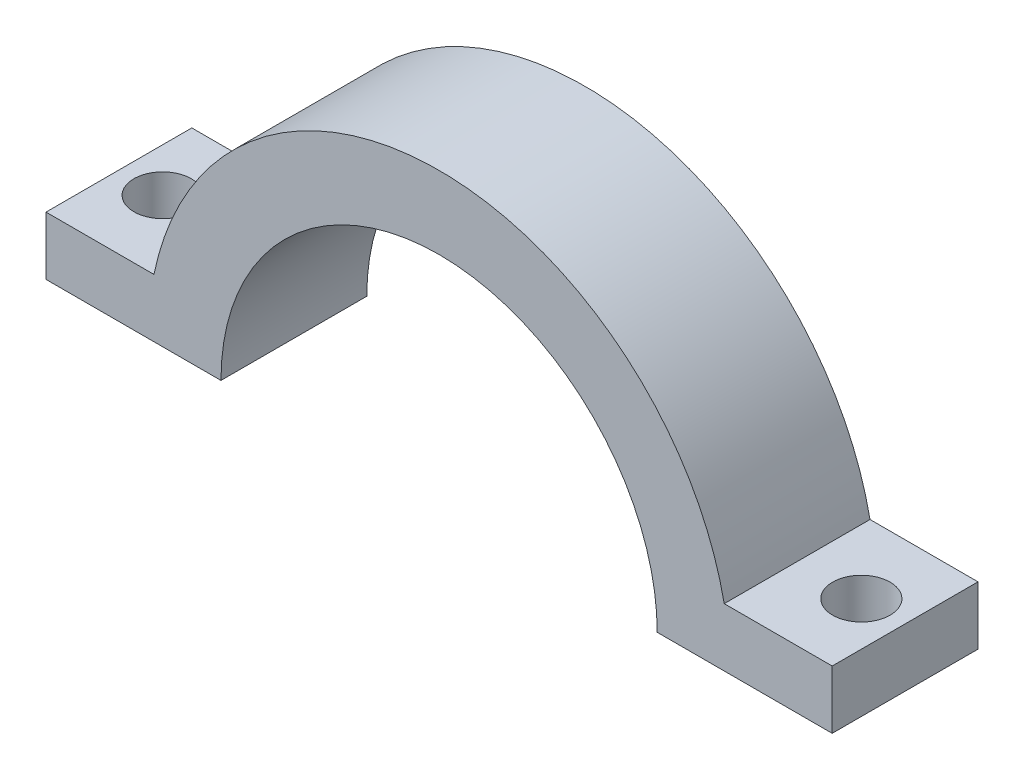
ISO-10303-21;
HEADER;
FILE_DESCRIPTION(('STEP AP214'),'2;1');
FILE_NAME('part.step','',(''),(''),'','','');
FILE_SCHEMA(('AUTOMOTIVE_DESIGN { 1 0 10303 214 1 1 1 1 }'));
ENDSEC;
DATA;
#1=APPLICATION_CONTEXT('core data for automotive mechanical design processes');
#2=APPLICATION_PROTOCOL_DEFINITION('international standard','automotive_design',2000,#1);
#3=PRODUCT_CONTEXT('',#1,'mechanical');
#4=PRODUCT('Part','Part','',(#3));
#5=PRODUCT_RELATED_PRODUCT_CATEGORY('part','',(#4));
#6=PRODUCT_DEFINITION_FORMATION('','',#4);
#7=PRODUCT_DEFINITION_CONTEXT('part definition',#1,'design');
#8=PRODUCT_DEFINITION('design','',#6,#7);
#9=PRODUCT_DEFINITION_SHAPE('','',#8);
#10=(LENGTH_UNIT() NAMED_UNIT(*) SI_UNIT(.MILLI.,.METRE.));
#11=(NAMED_UNIT(*) PLANE_ANGLE_UNIT() SI_UNIT($,.RADIAN.));
#12=(NAMED_UNIT(*) SI_UNIT($,.STERADIAN.) SOLID_ANGLE_UNIT());
#13=UNCERTAINTY_MEASURE_WITH_UNIT(LENGTH_MEASURE(1.E-05),#10,'distance_accuracy_value','');
#14=(GEOMETRIC_REPRESENTATION_CONTEXT(3) GLOBAL_UNCERTAINTY_ASSIGNED_CONTEXT((#13)) GLOBAL_UNIT_ASSIGNED_CONTEXT((#10,
#11,#12)) REPRESENTATION_CONTEXT('',''));
#15=CARTESIAN_POINT('',(0.,0.,0.));
#16=DIRECTION('',(0.,0.,1.));
#17=DIRECTION('',(1.,0.,0.));
#18=AXIS2_PLACEMENT_3D('',#15,#16,#17);
#19=CARTESIAN_POINT('',(0.,0.,12.7));
#20=DIRECTION('',(0.,0.,-1.));
#21=DIRECTION('',(-1.,0.,0.));
#22=AXIS2_PLACEMENT_3D('',#19,#20,#21);
#23=CYLINDRICAL_SURFACE('',#22,25.35);
#24=CARTESIAN_POINT('',(0.,0.,12.7));
#25=DIRECTION('',(0.,0.,1.));
#26=DIRECTION('',(1.,0.,0.));
#27=AXIS2_PLACEMENT_3D('',#24,#25,#26);
#28=CIRCLE('',#27,25.35);
#29=CARTESIAN_POINT('',(24.8357826532606,5.08,12.7));
#30=VERTEX_POINT('',#29);
#31=CARTESIAN_POINT('',(-24.8357826532606,5.08,12.7));
#32=VERTEX_POINT('',#31);
#33=EDGE_CURVE('E186',#30,#32,#28,.T.);
#34=ORIENTED_EDGE('',*,*,#33,.F.);
#35=DIRECTION('',(0.,0.,-1.));
#36=VECTOR('',#35,1.);
#37=CARTESIAN_POINT('',(24.8357826532606,5.08,12.7));
#38=LINE('',#37,#36);
#39=CARTESIAN_POINT('',(24.8357826532606,5.08,0.));
#40=VERTEX_POINT('',#39);
#41=EDGE_CURVE('E11',#30,#40,#38,.T.);
#42=ORIENTED_EDGE('',*,*,#41,.T.);
#43=CARTESIAN_POINT('',(0.,0.,0.));
#44=DIRECTION('',(0.,0.,1.));
#45=DIRECTION('',(1.,0.,0.));
#46=AXIS2_PLACEMENT_3D('',#43,#44,#45);
#47=CIRCLE('',#46,25.35);
#48=CARTESIAN_POINT('',(-24.8357826532606,5.08,0.));
#49=VERTEX_POINT('',#48);
#50=EDGE_CURVE('E60',#40,#49,#47,.T.);
#51=ORIENTED_EDGE('',*,*,#50,.T.);
#52=DIRECTION('',(0.,0.,-1.));
#53=VECTOR('',#52,1.);
#54=CARTESIAN_POINT('',(-24.8357826532606,5.08,12.7));
#55=LINE('',#54,#53);
#56=EDGE_CURVE('E54',#32,#49,#55,.T.);
#57=ORIENTED_EDGE('',*,*,#56,.F.);
#58=EDGE_LOOP('',(#34,#42,#51,#57));
#59=FACE_BOUND('',#58,.T.);
#60=ADVANCED_FACE('F45',(#59),#23,.T.);
#61=CARTESIAN_POINT('',(0.,0.,0.));
#62=DIRECTION('',(0.,1.,0.));
#63=DIRECTION('',(0.,0.,1.));
#64=AXIS2_PLACEMENT_3D('',#61,#62,#63);
#65=PLANE('',#64);
#66=DIRECTION('',(-1.,0.,0.));
#67=VECTOR('',#66,1.);
#68=CARTESIAN_POINT('',(0.,0.,12.7));
#69=LINE('',#68,#67);
#70=CARTESIAN_POINT('',(34.24,0.,12.7));
#71=VERTEX_POINT('',#70);
#72=CARTESIAN_POINT('',(19.,0.,12.7));
#73=VERTEX_POINT('',#72);
#74=EDGE_CURVE('E114',#71,#73,#69,.T.);
#75=ORIENTED_EDGE('',*,*,#74,.T.);
#76=DIRECTION('',(0.,0.,-1.));
#77=VECTOR('',#76,1.);
#78=CARTESIAN_POINT('',(19.,0.,12.7));
#79=LINE('',#78,#77);
#80=CARTESIAN_POINT('',(19.,0.,0.));
#81=VERTEX_POINT('',#80);
#82=EDGE_CURVE('E196',#73,#81,#79,.T.);
#83=ORIENTED_EDGE('',*,*,#82,.T.);
#84=DIRECTION('',(-1.,0.,0.));
#85=VECTOR('',#84,1.);
#86=CARTESIAN_POINT('',(0.,0.,0.));
#87=LINE('',#86,#85);
#88=CARTESIAN_POINT('',(34.24,0.,0.));
#89=VERTEX_POINT('',#88);
#90=EDGE_CURVE('E201',#89,#81,#87,.T.);
#91=ORIENTED_EDGE('',*,*,#90,.F.);
#92=DIRECTION('',(0.,0.,1.));
#93=VECTOR('',#92,1.);
#94=CARTESIAN_POINT('',(34.24,0.,12.7));
#95=LINE('',#94,#93);
#96=EDGE_CURVE('E134',#89,#71,#95,.T.);
#97=ORIENTED_EDGE('',*,*,#96,.T.);
#98=EDGE_LOOP('',(#75,#83,#91,#97));
#99=FACE_BOUND('',#98,.T.);
#100=CARTESIAN_POINT('',(30.43,0.,6.35));
#101=DIRECTION('',(0.,-1.,0.));
#102=DIRECTION('',(0.,0.,-1.));
#103=AXIS2_PLACEMENT_3D('',#100,#101,#102);
#104=CIRCLE('',#103,2.5);
#105=CARTESIAN_POINT('',(30.43,0.,3.85));
#106=VERTEX_POINT('',#105);
#107=EDGE_CURVE('E140',#106,#106,#104,.T.);
#108=ORIENTED_EDGE('',*,*,#107,.F.);
#109=EDGE_LOOP('',(#108));
#110=FACE_BOUND('',#109,.T.);
#111=ADVANCED_FACE('F47',(#99,#110),#65,.F.);
#112=CARTESIAN_POINT('',(-19.,0.,0.));
#113=VERTEX_POINT('',#112);
#114=CARTESIAN_POINT('',(-34.24,0.,0.));
#115=VERTEX_POINT('',#114);
#116=EDGE_CURVE('E189',#113,#115,#87,.T.);
#117=ORIENTED_EDGE('',*,*,#116,.F.);
#118=DIRECTION('',(0.,0.,-1.));
#119=VECTOR('',#118,1.);
#120=CARTESIAN_POINT('',(-19.,0.,12.7));
#121=LINE('',#120,#119);
#122=CARTESIAN_POINT('',(-19.,0.,12.7));
#123=VERTEX_POINT('',#122);
#124=EDGE_CURVE('E192',#113,#123,#121,.F.);
#125=ORIENTED_EDGE('',*,*,#124,.T.);
#126=CARTESIAN_POINT('',(-34.24,0.,12.7));
#127=VERTEX_POINT('',#126);
#128=EDGE_CURVE('E200',#123,#127,#69,.T.);
#129=ORIENTED_EDGE('',*,*,#128,.T.);
#130=DIRECTION('',(0.,0.,-1.));
#131=VECTOR('',#130,1.);
#132=CARTESIAN_POINT('',(-34.24,0.,12.7));
#133=LINE('',#132,#131);
#134=EDGE_CURVE('E157',#127,#115,#133,.T.);
#135=ORIENTED_EDGE('',*,*,#134,.T.);
#136=EDGE_LOOP('',(#117,#125,#129,#135));
#137=FACE_BOUND('',#136,.T.);
#138=CARTESIAN_POINT('',(-30.43,0.,6.35));
#139=DIRECTION('',(0.,-1.,0.));
#140=DIRECTION('',(0.,0.,1.));
#141=AXIS2_PLACEMENT_3D('',#138,#139,#140);
#142=CIRCLE('',#141,2.5);
#143=CARTESIAN_POINT('',(-30.43,0.,8.85));
#144=VERTEX_POINT('',#143);
#145=EDGE_CURVE('E172',#144,#144,#142,.T.);
#146=ORIENTED_EDGE('',*,*,#145,.F.);
#147=EDGE_LOOP('',(#146));
#148=FACE_BOUND('',#147,.T.);
#149=ADVANCED_FACE('F219',(#137,#148),#65,.F.);
#150=CARTESIAN_POINT('',(0.,0.,12.7));
#151=DIRECTION('',(0.,0.,1.));
#152=DIRECTION('',(1.,0.,0.));
#153=AXIS2_PLACEMENT_3D('',#150,#151,#152);
#154=PLANE('',#153);
#155=CARTESIAN_POINT('',(0.,0.,12.7));
#156=DIRECTION('',(0.,0.,1.));
#157=DIRECTION('',(1.,0.,0.));
#158=AXIS2_PLACEMENT_3D('',#155,#156,#157);
#159=CIRCLE('',#158,19.);
#160=EDGE_CURVE('E179',#73,#123,#159,.T.);
#161=ORIENTED_EDGE('',*,*,#160,.F.);
#162=ORIENTED_EDGE('',*,*,#74,.F.);
#163=DIRECTION('',(0.,-1.,0.));
#164=VECTOR('',#163,1.);
#165=CARTESIAN_POINT('',(34.24,5.08,12.7));
#166=LINE('',#165,#164);
#167=CARTESIAN_POINT('',(34.24,5.08,12.7));
#168=VERTEX_POINT('',#167);
#169=EDGE_CURVE('E107',#168,#71,#166,.T.);
#170=ORIENTED_EDGE('',*,*,#169,.F.);
#171=DIRECTION('',(-1.,0.,0.));
#172=VECTOR('',#171,1.);
#173=CARTESIAN_POINT('',(19.,5.08,12.7));
#174=LINE('',#173,#172);
#175=EDGE_CURVE('E112',#168,#30,#174,.T.);
#176=ORIENTED_EDGE('',*,*,#175,.T.);
#177=ORIENTED_EDGE('',*,*,#33,.T.);
#178=DIRECTION('',(-1.,0.,0.));
#179=VECTOR('',#178,1.);
#180=CARTESIAN_POINT('',(-19.,5.08,12.7));
#181=LINE('',#180,#179);
#182=CARTESIAN_POINT('',(-34.24,5.08,12.7));
#183=VERTEX_POINT('',#182);
#184=EDGE_CURVE('E166',#32,#183,#181,.T.);
#185=ORIENTED_EDGE('',*,*,#184,.T.);
#186=DIRECTION('',(0.,-1.,0.));
#187=VECTOR('',#186,1.);
#188=CARTESIAN_POINT('',(-34.24,5.08,12.7));
#189=LINE('',#188,#187);
#190=EDGE_CURVE('E148',#183,#127,#189,.T.);
#191=ORIENTED_EDGE('',*,*,#190,.T.);
#192=ORIENTED_EDGE('',*,*,#128,.F.);
#193=EDGE_LOOP('',(#161,#162,#170,#176,#177,#185,#191,#192));
#194=FACE_BOUND('',#193,.T.);
#195=ADVANCED_FACE('F110',(#194),#154,.T.);
#196=CARTESIAN_POINT('',(0.,0.,0.));
#197=DIRECTION('',(0.,0.,1.));
#198=DIRECTION('',(1.,0.,0.));
#199=AXIS2_PLACEMENT_3D('',#196,#197,#198);
#200=PLANE('',#199);
#201=ORIENTED_EDGE('',*,*,#90,.T.);
#202=CARTESIAN_POINT('',(0.,0.,0.));
#203=DIRECTION('',(0.,0.,1.));
#204=DIRECTION('',(1.,0.,0.));
#205=AXIS2_PLACEMENT_3D('',#202,#203,#204);
#206=CIRCLE('',#205,19.);
#207=EDGE_CURVE('E146',#81,#113,#206,.T.);
#208=ORIENTED_EDGE('',*,*,#207,.T.);
#209=ORIENTED_EDGE('',*,*,#116,.T.);
#210=DIRECTION('',(0.,-1.,0.));
#211=VECTOR('',#210,1.);
#212=CARTESIAN_POINT('',(-34.24,5.08,0.));
#213=LINE('',#212,#211);
#214=CARTESIAN_POINT('',(-34.24,5.08,0.));
#215=VERTEX_POINT('',#214);
#216=EDGE_CURVE('E153',#215,#115,#213,.T.);
#217=ORIENTED_EDGE('',*,*,#216,.F.);
#218=DIRECTION('',(1.,0.,0.));
#219=VECTOR('',#218,1.);
#220=CARTESIAN_POINT('',(-34.24,5.08,0.));
#221=LINE('',#220,#219);
#222=EDGE_CURVE('E162',#215,#49,#221,.T.);
#223=ORIENTED_EDGE('',*,*,#222,.T.);
#224=ORIENTED_EDGE('',*,*,#50,.F.);
#225=DIRECTION('',(1.,0.,0.));
#226=VECTOR('',#225,1.);
#227=CARTESIAN_POINT('',(34.24,5.08,0.));
#228=LINE('',#227,#226);
#229=CARTESIAN_POINT('',(34.24,5.08,0.));
#230=VERTEX_POINT('',#229);
#231=EDGE_CURVE('E121',#40,#230,#228,.T.);
#232=ORIENTED_EDGE('',*,*,#231,.T.);
#233=DIRECTION('',(0.,-1.,0.));
#234=VECTOR('',#233,1.);
#235=CARTESIAN_POINT('',(34.24,5.08,0.));
#236=LINE('',#235,#234);
#237=EDGE_CURVE('E120',#230,#89,#236,.T.);
#238=ORIENTED_EDGE('',*,*,#237,.T.);
#239=EDGE_LOOP('',(#201,#208,#209,#217,#223,#224,#232,#238));
#240=FACE_BOUND('',#239,.T.);
#241=ADVANCED_FACE('F212',(#240),#200,.F.);
#242=CARTESIAN_POINT('',(0.,0.,12.7));
#243=DIRECTION('',(0.,0.,-1.));
#244=DIRECTION('',(-1.,0.,0.));
#245=AXIS2_PLACEMENT_3D('',#242,#243,#244);
#246=CYLINDRICAL_SURFACE('',#245,19.);
#247=ORIENTED_EDGE('',*,*,#82,.F.);
#248=ORIENTED_EDGE('',*,*,#160,.T.);
#249=ORIENTED_EDGE('',*,*,#124,.F.);
#250=ORIENTED_EDGE('',*,*,#207,.F.);
#251=EDGE_LOOP('',(#247,#248,#249,#250));
#252=FACE_BOUND('',#251,.T.);
#253=ADVANCED_FACE('F230',(#252),#246,.F.);
#254=CARTESIAN_POINT('',(0.,5.08,0.));
#255=DIRECTION('',(0.,-1.,0.));
#256=DIRECTION('',(0.,0.,-1.));
#257=AXIS2_PLACEMENT_3D('',#254,#255,#256);
#258=PLANE('',#257);
#259=CARTESIAN_POINT('',(-30.43,5.08,6.35));
#260=DIRECTION('',(0.,-1.,0.));
#261=DIRECTION('',(0.,0.,1.));
#262=AXIS2_PLACEMENT_3D('',#259,#260,#261);
#263=CIRCLE('',#262,2.5);
#264=CARTESIAN_POINT('',(-30.43,5.08,8.85));
#265=VERTEX_POINT('',#264);
#266=EDGE_CURVE('E161',#265,#265,#263,.T.);
#267=ORIENTED_EDGE('',*,*,#266,.T.);
#268=EDGE_LOOP('',(#267));
#269=FACE_BOUND('',#268,.T.);
#270=ORIENTED_EDGE('',*,*,#184,.F.);
#271=ORIENTED_EDGE('',*,*,#56,.T.);
#272=ORIENTED_EDGE('',*,*,#222,.F.);
#273=DIRECTION('',(0.,0.,-1.));
#274=VECTOR('',#273,1.);
#275=CARTESIAN_POINT('',(-34.24,5.08,12.7));
#276=LINE('',#275,#274);
#277=EDGE_CURVE('E152',#183,#215,#276,.T.);
#278=ORIENTED_EDGE('',*,*,#277,.F.);
#279=EDGE_LOOP('',(#270,#271,#272,#278));
#280=FACE_BOUND('',#279,.T.);
#281=ADVANCED_FACE('F209',(#269,#280),#258,.F.);
#282=CARTESIAN_POINT('',(-34.24,5.08,12.7));
#283=DIRECTION('',(-1.,0.,0.));
#284=DIRECTION('',(0.,0.,1.));
#285=AXIS2_PLACEMENT_3D('',#282,#283,#284);
#286=PLANE('',#285);
#287=ORIENTED_EDGE('',*,*,#134,.F.);
#288=ORIENTED_EDGE('',*,*,#190,.F.);
#289=ORIENTED_EDGE('',*,*,#277,.T.);
#290=ORIENTED_EDGE('',*,*,#216,.T.);
#291=EDGE_LOOP('',(#287,#288,#289,#290));
#292=FACE_BOUND('',#291,.T.);
#293=ADVANCED_FACE('F216',(#292),#286,.T.);
#294=CARTESIAN_POINT('',(-30.43,5.08,6.35));
#295=DIRECTION('',(0.,-1.,0.));
#296=DIRECTION('',(0.,0.,-1.));
#297=AXIS2_PLACEMENT_3D('',#294,#295,#296);
#298=CYLINDRICAL_SURFACE('',#297,2.5);
#299=ORIENTED_EDGE('',*,*,#266,.F.);
#300=EDGE_LOOP('',(#299));
#301=FACE_BOUND('',#300,.T.);
#302=ORIENTED_EDGE('',*,*,#145,.T.);
#303=EDGE_LOOP('',(#302));
#304=FACE_BOUND('',#303,.T.);
#305=ADVANCED_FACE('F235',(#301,#304),#298,.F.);
#306=CARTESIAN_POINT('',(0.,5.08,0.));
#307=DIRECTION('',(0.,1.,0.));
#308=DIRECTION('',(0.,0.,1.));
#309=AXIS2_PLACEMENT_3D('',#306,#307,#308);
#310=PLANE('',#309);
#311=CARTESIAN_POINT('',(30.43,5.08,6.35));
#312=DIRECTION('',(0.,-1.,0.));
#313=DIRECTION('',(0.,0.,-1.));
#314=AXIS2_PLACEMENT_3D('',#311,#312,#313);
#315=CIRCLE('',#314,2.5);
#316=CARTESIAN_POINT('',(30.43,5.08,3.85));
#317=VERTEX_POINT('',#316);
#318=EDGE_CURVE('E137',#317,#317,#315,.T.);
#319=ORIENTED_EDGE('',*,*,#318,.T.);
#320=EDGE_LOOP('',(#319));
#321=FACE_BOUND('',#320,.T.);
#322=ORIENTED_EDGE('',*,*,#41,.F.);
#323=ORIENTED_EDGE('',*,*,#175,.F.);
#324=DIRECTION('',(0.,0.,1.));
#325=VECTOR('',#324,1.);
#326=CARTESIAN_POINT('',(34.24,5.08,12.7));
#327=LINE('',#326,#325);
#328=EDGE_CURVE('E127',#230,#168,#327,.T.);
#329=ORIENTED_EDGE('',*,*,#328,.F.);
#330=ORIENTED_EDGE('',*,*,#231,.F.);
#331=EDGE_LOOP('',(#322,#323,#329,#330));
#332=FACE_BOUND('',#331,.T.);
#333=ADVANCED_FACE('F125',(#321,#332),#310,.T.);
#334=CARTESIAN_POINT('',(34.24,5.08,12.7));
#335=DIRECTION('',(1.,0.,0.));
#336=DIRECTION('',(0.,0.,-1.));
#337=AXIS2_PLACEMENT_3D('',#334,#335,#336);
#338=PLANE('',#337);
#339=ORIENTED_EDGE('',*,*,#96,.F.);
#340=ORIENTED_EDGE('',*,*,#237,.F.);
#341=ORIENTED_EDGE('',*,*,#328,.T.);
#342=ORIENTED_EDGE('',*,*,#169,.T.);
#343=EDGE_LOOP('',(#339,#340,#341,#342));
#344=FACE_BOUND('',#343,.T.);
#345=ADVANCED_FACE('F131',(#344),#338,.T.);
#346=CARTESIAN_POINT('',(30.43,5.08,6.35));
#347=DIRECTION('',(0.,-1.,0.));
#348=DIRECTION('',(0.,0.,-1.));
#349=AXIS2_PLACEMENT_3D('',#346,#347,#348);
#350=CYLINDRICAL_SURFACE('',#349,2.5);
#351=ORIENTED_EDGE('',*,*,#318,.F.);
#352=EDGE_LOOP('',(#351));
#353=FACE_BOUND('',#352,.T.);
#354=ORIENTED_EDGE('',*,*,#107,.T.);
#355=EDGE_LOOP('',(#354));
#356=FACE_BOUND('',#355,.T.);
#357=ADVANCED_FACE('F246',(#353,#356),#350,.F.);
#358=CLOSED_SHELL('',(#60,#111,#149,#195,#241,#253,#281,#293,#305,#333,#345,#357));
#359=MANIFOLD_SOLID_BREP('B2',#358);
#360=ADVANCED_BREP_SHAPE_REPRESENTATION('',(#18,#359),#14);
#361=SHAPE_DEFINITION_REPRESENTATION(#9,#360);
ENDSEC;
END-ISO-10303-21;
